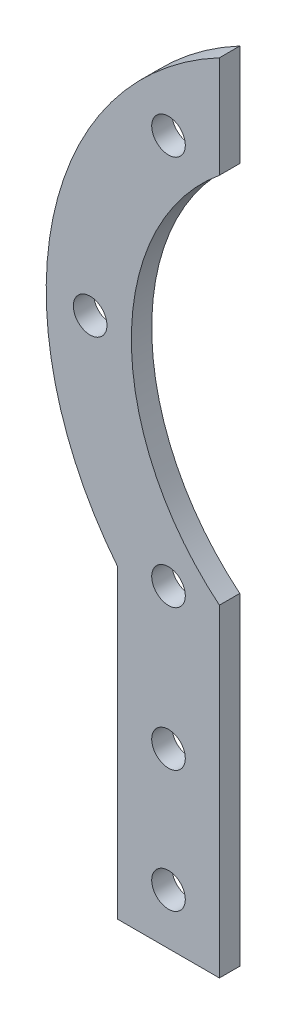
ISO-10303-21;
HEADER;
FILE_DESCRIPTION(('STEP AP214'),'2;1');
FILE_NAME('part.step','',(''),(''),'','','');
FILE_SCHEMA(('AUTOMOTIVE_DESIGN { 1 0 10303 214 1 1 1 1 }'));
ENDSEC;
DATA;
#1=APPLICATION_CONTEXT('core data for automotive mechanical design processes');
#2=APPLICATION_PROTOCOL_DEFINITION('international standard','automotive_design',2000,#1);
#3=PRODUCT_CONTEXT('',#1,'mechanical');
#4=PRODUCT('Part','Part','',(#3));
#5=PRODUCT_RELATED_PRODUCT_CATEGORY('part','',(#4));
#6=PRODUCT_DEFINITION_FORMATION('','',#4);
#7=PRODUCT_DEFINITION_CONTEXT('part definition',#1,'design');
#8=PRODUCT_DEFINITION('design','',#6,#7);
#9=PRODUCT_DEFINITION_SHAPE('','',#8);
#10=(LENGTH_UNIT() NAMED_UNIT(*) SI_UNIT(.MILLI.,.METRE.));
#11=(NAMED_UNIT(*) PLANE_ANGLE_UNIT() SI_UNIT($,.RADIAN.));
#12=(NAMED_UNIT(*) SI_UNIT($,.STERADIAN.) SOLID_ANGLE_UNIT());
#13=UNCERTAINTY_MEASURE_WITH_UNIT(LENGTH_MEASURE(1.E-05),#10,'distance_accuracy_value','');
#14=(GEOMETRIC_REPRESENTATION_CONTEXT(3) GLOBAL_UNCERTAINTY_ASSIGNED_CONTEXT((#13)) GLOBAL_UNIT_ASSIGNED_CONTEXT((#10,
#11,#12)) REPRESENTATION_CONTEXT('',''));
#15=CARTESIAN_POINT('',(0.,0.,0.));
#16=DIRECTION('',(0.,0.,1.));
#17=DIRECTION('',(1.,0.,0.));
#18=AXIS2_PLACEMENT_3D('',#15,#16,#17);
#19=CARTESIAN_POINT('',(25.,50.,2.));
#20=DIRECTION('',(0.,0.,1.));
#21=DIRECTION('',(1.,0.,0.));
#22=AXIS2_PLACEMENT_3D('',#19,#20,#21);
#23=PLANE('',#22);
#24=CARTESIAN_POINT('',(5.,69.1613487919139,2.));
#25=DIRECTION('',(0.,0.,1.));
#26=DIRECTION('',(1.,0.,0.));
#27=AXIS2_PLACEMENT_3D('',#24,#25,#26);
#28=CIRCLE('',#27,1.65);
#29=CARTESIAN_POINT('',(6.65,69.1613487919139,2.));
#30=VERTEX_POINT('',#29);
#31=EDGE_CURVE('E216',#30,#30,#28,.T.);
#32=ORIENTED_EDGE('',*,*,#31,.F.);
#33=EDGE_LOOP('',(#32));
#34=FACE_BOUND('',#33,.T.);
#35=CARTESIAN_POINT('',(5.,17.,2.));
#36=DIRECTION('',(0.,0.,1.));
#37=DIRECTION('',(1.,0.,0.));
#38=AXIS2_PLACEMENT_3D('',#35,#36,#37);
#39=CIRCLE('',#38,1.65);
#40=CARTESIAN_POINT('',(6.65,17.,2.));
#41=VERTEX_POINT('',#40);
#42=EDGE_CURVE('E232',#41,#41,#39,.T.);
#43=ORIENTED_EDGE('',*,*,#42,.F.);
#44=EDGE_LOOP('',(#43));
#45=FACE_BOUND('',#44,.T.);
#46=DIRECTION('',(0.,-1.,0.));
#47=VECTOR('',#46,1.);
#48=CARTESIAN_POINT('',(0.,0.,2.));
#49=LINE('',#48,#47);
#50=CARTESIAN_POINT('',(0.,30.,2.));
#51=VERTEX_POINT('',#50);
#52=CARTESIAN_POINT('',(0.,0.,2.));
#53=VERTEX_POINT('',#52);
#54=EDGE_CURVE('E146',#51,#53,#49,.T.);
#55=ORIENTED_EDGE('',*,*,#54,.T.);
#56=DIRECTION('',(1.,0.,0.));
#57=VECTOR('',#56,1.);
#58=CARTESIAN_POINT('',(0.,0.,2.));
#59=LINE('',#58,#57);
#60=CARTESIAN_POINT('',(10.,0.,2.));
#61=VERTEX_POINT('',#60);
#62=EDGE_CURVE('E94',#53,#61,#59,.T.);
#63=ORIENTED_EDGE('',*,*,#62,.T.);
#64=DIRECTION('',(0.,1.,0.));
#65=VECTOR('',#64,1.);
#66=CARTESIAN_POINT('',(10.,0.,2.));
#67=LINE('',#66,#65);
#68=CARTESIAN_POINT('',(10.,31.7157287525381,2.));
#69=VERTEX_POINT('',#68);
#70=EDGE_CURVE('E107',#61,#69,#67,.T.);
#71=ORIENTED_EDGE('',*,*,#70,.T.);
#72=CARTESIAN_POINT('',(25.,50.,2.));
#73=DIRECTION('',(0.,0.,-1.));
#74=DIRECTION('',(1.,0.,0.));
#75=AXIS2_PLACEMENT_3D('',#72,#73,#74);
#76=CIRCLE('',#75,23.649832452911);
#77=CARTESIAN_POINT('',(10.,68.2842712474619,2.));
#78=VERTEX_POINT('',#77);
#79=EDGE_CURVE('E101',#69,#78,#76,.T.);
#80=ORIENTED_EDGE('',*,*,#79,.T.);
#81=DIRECTION('',(0.,1.,0.));
#82=VECTOR('',#81,1.);
#83=CARTESIAN_POINT('',(10.,68.2842712474619,2.));
#84=LINE('',#83,#82);
#85=CARTESIAN_POINT('',(10.,78.2842712474619,2.));
#86=VERTEX_POINT('',#85);
#87=EDGE_CURVE('E105',#78,#86,#84,.T.);
#88=ORIENTED_EDGE('',*,*,#87,.T.);
#89=CARTESIAN_POINT('',(25.,50.,2.));
#90=DIRECTION('',(0.,0.,1.));
#91=DIRECTION('',(1.,0.,0.));
#92=AXIS2_PLACEMENT_3D('',#89,#90,#91);
#93=CIRCLE('',#92,32.0156211871642);
#94=EDGE_CURVE('E57',#86,#51,#93,.T.);
#95=ORIENTED_EDGE('',*,*,#94,.T.);
#96=EDGE_LOOP('',(#55,#63,#71,#80,#88,#95));
#97=FACE_BOUND('',#96,.T.);
#98=CARTESIAN_POINT('',(5.,5.,2.));
#99=DIRECTION('',(0.,0.,1.));
#100=DIRECTION('',(1.,0.,0.));
#101=AXIS2_PLACEMENT_3D('',#98,#99,#100);
#102=CIRCLE('',#101,1.65);
#103=CARTESIAN_POINT('',(6.65,5.,2.));
#104=VERTEX_POINT('',#103);
#105=EDGE_CURVE('E134',#104,#104,#102,.T.);
#106=ORIENTED_EDGE('',*,*,#105,.F.);
#107=EDGE_LOOP('',(#106));
#108=FACE_BOUND('',#107,.T.);
#109=CARTESIAN_POINT('',(-2.69760436437384,50.,2.));
#110=DIRECTION('',(0.,0.,1.));
#111=DIRECTION('',(1.,0.,0.));
#112=AXIS2_PLACEMENT_3D('',#109,#110,#111);
#113=CIRCLE('',#112,1.65);
#114=CARTESIAN_POINT('',(-1.04760436437384,50.,2.));
#115=VERTEX_POINT('',#114);
#116=EDGE_CURVE('E224',#115,#115,#113,.T.);
#117=ORIENTED_EDGE('',*,*,#116,.F.);
#118=EDGE_LOOP('',(#117));
#119=FACE_BOUND('',#118,.T.);
#120=CARTESIAN_POINT('',(5.,30.8386512080861,2.));
#121=DIRECTION('',(0.,0.,1.));
#122=DIRECTION('',(1.,0.,0.));
#123=AXIS2_PLACEMENT_3D('',#120,#121,#122);
#124=CIRCLE('',#123,1.65);
#125=CARTESIAN_POINT('',(6.65,30.8386512080861,2.));
#126=VERTEX_POINT('',#125);
#127=EDGE_CURVE('E205',#126,#126,#124,.T.);
#128=ORIENTED_EDGE('',*,*,#127,.F.);
#129=EDGE_LOOP('',(#128));
#130=FACE_BOUND('',#129,.T.);
#131=ADVANCED_FACE('F39',(#34,#45,#97,#108,#119,#130),#23,.T.);
#132=CARTESIAN_POINT('',(25.,50.,0.));
#133=DIRECTION('',(0.,0.,1.));
#134=DIRECTION('',(1.,0.,0.));
#135=AXIS2_PLACEMENT_3D('',#132,#133,#134);
#136=PLANE('',#135);
#137=DIRECTION('',(0.,-1.,0.));
#138=VECTOR('',#137,1.);
#139=CARTESIAN_POINT('',(0.,0.,0.));
#140=LINE('',#139,#138);
#141=CARTESIAN_POINT('',(0.,30.,0.));
#142=VERTEX_POINT('',#141);
#143=CARTESIAN_POINT('',(0.,0.,0.));
#144=VERTEX_POINT('',#143);
#145=EDGE_CURVE('E129',#142,#144,#140,.T.);
#146=ORIENTED_EDGE('',*,*,#145,.F.);
#147=CARTESIAN_POINT('',(25.,50.,0.));
#148=DIRECTION('',(0.,0.,1.));
#149=DIRECTION('',(1.,0.,0.));
#150=AXIS2_PLACEMENT_3D('',#147,#148,#149);
#151=CIRCLE('',#150,32.0156211871642);
#152=CARTESIAN_POINT('',(10.,78.2842712474619,0.));
#153=VERTEX_POINT('',#152);
#154=EDGE_CURVE('E86',#153,#142,#151,.T.);
#155=ORIENTED_EDGE('',*,*,#154,.F.);
#156=DIRECTION('',(0.,1.,0.));
#157=VECTOR('',#156,1.);
#158=CARTESIAN_POINT('',(10.,68.2842712474619,0.));
#159=LINE('',#158,#157);
#160=CARTESIAN_POINT('',(10.,68.2842712474619,0.));
#161=VERTEX_POINT('',#160);
#162=EDGE_CURVE('E80',#161,#153,#159,.T.);
#163=ORIENTED_EDGE('',*,*,#162,.F.);
#164=CARTESIAN_POINT('',(25.,50.,0.));
#165=DIRECTION('',(0.,0.,-1.));
#166=DIRECTION('',(1.,0.,0.));
#167=AXIS2_PLACEMENT_3D('',#164,#165,#166);
#168=CIRCLE('',#167,23.649832452911);
#169=CARTESIAN_POINT('',(10.,31.7157287525381,0.));
#170=VERTEX_POINT('',#169);
#171=EDGE_CURVE('E116',#170,#161,#168,.T.);
#172=ORIENTED_EDGE('',*,*,#171,.F.);
#173=DIRECTION('',(0.,1.,0.));
#174=VECTOR('',#173,1.);
#175=CARTESIAN_POINT('',(10.,0.,0.));
#176=LINE('',#175,#174);
#177=CARTESIAN_POINT('',(10.,0.,0.));
#178=VERTEX_POINT('',#177);
#179=EDGE_CURVE('E137',#178,#170,#176,.T.);
#180=ORIENTED_EDGE('',*,*,#179,.F.);
#181=DIRECTION('',(1.,0.,0.));
#182=VECTOR('',#181,1.);
#183=CARTESIAN_POINT('',(0.,0.,0.));
#184=LINE('',#183,#182);
#185=EDGE_CURVE('E133',#144,#178,#184,.T.);
#186=ORIENTED_EDGE('',*,*,#185,.F.);
#187=EDGE_LOOP('',(#146,#155,#163,#172,#180,#186));
#188=FACE_BOUND('',#187,.T.);
#189=CARTESIAN_POINT('',(5.,5.,0.));
#190=DIRECTION('',(0.,0.,1.));
#191=DIRECTION('',(1.,0.,0.));
#192=AXIS2_PLACEMENT_3D('',#189,#190,#191);
#193=CIRCLE('',#192,1.65);
#194=CARTESIAN_POINT('',(6.65,5.,0.));
#195=VERTEX_POINT('',#194);
#196=EDGE_CURVE('E236',#195,#195,#193,.T.);
#197=ORIENTED_EDGE('',*,*,#196,.T.);
#198=EDGE_LOOP('',(#197));
#199=FACE_BOUND('',#198,.T.);
#200=CARTESIAN_POINT('',(5.,17.,0.));
#201=DIRECTION('',(0.,0.,1.));
#202=DIRECTION('',(1.,0.,0.));
#203=AXIS2_PLACEMENT_3D('',#200,#201,#202);
#204=CIRCLE('',#203,1.65);
#205=CARTESIAN_POINT('',(6.65,17.,0.));
#206=VERTEX_POINT('',#205);
#207=EDGE_CURVE('E228',#206,#206,#204,.T.);
#208=ORIENTED_EDGE('',*,*,#207,.T.);
#209=EDGE_LOOP('',(#208));
#210=FACE_BOUND('',#209,.T.);
#211=CARTESIAN_POINT('',(-2.69760436437384,50.,0.));
#212=DIRECTION('',(0.,0.,1.));
#213=DIRECTION('',(1.,0.,0.));
#214=AXIS2_PLACEMENT_3D('',#211,#212,#213);
#215=CIRCLE('',#214,1.65);
#216=CARTESIAN_POINT('',(-1.04760436437384,50.,0.));
#217=VERTEX_POINT('',#216);
#218=EDGE_CURVE('E220',#217,#217,#215,.T.);
#219=ORIENTED_EDGE('',*,*,#218,.T.);
#220=EDGE_LOOP('',(#219));
#221=FACE_BOUND('',#220,.T.);
#222=CARTESIAN_POINT('',(5.,69.1613487919139,0.));
#223=DIRECTION('',(0.,0.,1.));
#224=DIRECTION('',(1.,0.,0.));
#225=AXIS2_PLACEMENT_3D('',#222,#223,#224);
#226=CIRCLE('',#225,1.65);
#227=CARTESIAN_POINT('',(6.65,69.1613487919139,0.));
#228=VERTEX_POINT('',#227);
#229=EDGE_CURVE('E213',#228,#228,#226,.T.);
#230=ORIENTED_EDGE('',*,*,#229,.T.);
#231=EDGE_LOOP('',(#230));
#232=FACE_BOUND('',#231,.T.);
#233=CARTESIAN_POINT('',(5.,30.8386512080861,0.));
#234=DIRECTION('',(0.,0.,1.));
#235=DIRECTION('',(1.,0.,0.));
#236=AXIS2_PLACEMENT_3D('',#233,#234,#235);
#237=CIRCLE('',#236,1.65);
#238=CARTESIAN_POINT('',(6.65,30.8386512080861,0.));
#239=VERTEX_POINT('',#238);
#240=EDGE_CURVE('E208',#239,#239,#237,.T.);
#241=ORIENTED_EDGE('',*,*,#240,.T.);
#242=EDGE_LOOP('',(#241));
#243=FACE_BOUND('',#242,.T.);
#244=ADVANCED_FACE('F159',(#188,#199,#210,#221,#232,#243),#136,.F.);
#245=CARTESIAN_POINT('',(0.,0.,2.));
#246=DIRECTION('',(1.,0.,0.));
#247=DIRECTION('',(0.,0.,-1.));
#248=AXIS2_PLACEMENT_3D('',#245,#246,#247);
#249=PLANE('',#248);
#250=ORIENTED_EDGE('',*,*,#145,.T.);
#251=DIRECTION('',(0.,0.,-1.));
#252=VECTOR('',#251,1.);
#253=CARTESIAN_POINT('',(0.,0.,2.));
#254=LINE('',#253,#252);
#255=EDGE_CURVE('E11',#53,#144,#254,.T.);
#256=ORIENTED_EDGE('',*,*,#255,.F.);
#257=ORIENTED_EDGE('',*,*,#54,.F.);
#258=DIRECTION('',(0.,0.,-1.));
#259=VECTOR('',#258,1.);
#260=CARTESIAN_POINT('',(0.,30.,2.));
#261=LINE('',#260,#259);
#262=EDGE_CURVE('E125',#51,#142,#261,.T.);
#263=ORIENTED_EDGE('',*,*,#262,.T.);
#264=EDGE_LOOP('',(#250,#256,#257,#263));
#265=FACE_BOUND('',#264,.T.);
#266=ADVANCED_FACE('F41',(#265),#249,.F.);
#267=CARTESIAN_POINT('',(0.,0.,2.));
#268=DIRECTION('',(0.,1.,0.));
#269=DIRECTION('',(0.,0.,1.));
#270=AXIS2_PLACEMENT_3D('',#267,#268,#269);
#271=PLANE('',#270);
#272=ORIENTED_EDGE('',*,*,#185,.T.);
#273=DIRECTION('',(0.,0.,-1.));
#274=VECTOR('',#273,1.);
#275=CARTESIAN_POINT('',(10.,0.,2.));
#276=LINE('',#275,#274);
#277=EDGE_CURVE('E49',#61,#178,#276,.T.);
#278=ORIENTED_EDGE('',*,*,#277,.F.);
#279=ORIENTED_EDGE('',*,*,#62,.F.);
#280=ORIENTED_EDGE('',*,*,#255,.T.);
#281=EDGE_LOOP('',(#272,#278,#279,#280));
#282=FACE_BOUND('',#281,.T.);
#283=ADVANCED_FACE('F309',(#282),#271,.F.);
#284=CARTESIAN_POINT('',(10.,0.,2.));
#285=DIRECTION('',(-1.,0.,0.));
#286=DIRECTION('',(0.,0.,1.));
#287=AXIS2_PLACEMENT_3D('',#284,#285,#286);
#288=PLANE('',#287);
#289=ORIENTED_EDGE('',*,*,#179,.T.);
#290=DIRECTION('',(0.,0.,-1.));
#291=VECTOR('',#290,1.);
#292=CARTESIAN_POINT('',(10.,31.7157287525381,2.));
#293=LINE('',#292,#291);
#294=EDGE_CURVE('E118',#69,#170,#293,.T.);
#295=ORIENTED_EDGE('',*,*,#294,.F.);
#296=ORIENTED_EDGE('',*,*,#70,.F.);
#297=ORIENTED_EDGE('',*,*,#277,.T.);
#298=EDGE_LOOP('',(#289,#295,#296,#297));
#299=FACE_BOUND('',#298,.T.);
#300=ADVANCED_FACE('F156',(#299),#288,.F.);
#301=CARTESIAN_POINT('',(25.,50.,2.));
#302=DIRECTION('',(0.,0.,-1.));
#303=DIRECTION('',(-1.,0.,0.));
#304=AXIS2_PLACEMENT_3D('',#301,#302,#303);
#305=CYLINDRICAL_SURFACE('',#304,23.649832452911);
#306=ORIENTED_EDGE('',*,*,#171,.T.);
#307=DIRECTION('',(0.,0.,-1.));
#308=VECTOR('',#307,1.);
#309=CARTESIAN_POINT('',(10.,68.2842712474619,2.));
#310=LINE('',#309,#308);
#311=EDGE_CURVE('E113',#78,#161,#310,.T.);
#312=ORIENTED_EDGE('',*,*,#311,.F.);
#313=ORIENTED_EDGE('',*,*,#79,.F.);
#314=ORIENTED_EDGE('',*,*,#294,.T.);
#315=EDGE_LOOP('',(#306,#312,#313,#314));
#316=FACE_BOUND('',#315,.T.);
#317=ADVANCED_FACE('F114',(#316),#305,.F.);
#318=CARTESIAN_POINT('',(10.,68.2842712474619,2.));
#319=DIRECTION('',(-1.,0.,0.));
#320=DIRECTION('',(0.,-1.,0.));
#321=AXIS2_PLACEMENT_3D('',#318,#319,#320);
#322=PLANE('',#321);
#323=ORIENTED_EDGE('',*,*,#162,.T.);
#324=DIRECTION('',(0.,0.,-1.));
#325=VECTOR('',#324,1.);
#326=CARTESIAN_POINT('',(10.,78.2842712474619,2.));
#327=LINE('',#326,#325);
#328=EDGE_CURVE('E119',#86,#153,#327,.T.);
#329=ORIENTED_EDGE('',*,*,#328,.F.);
#330=ORIENTED_EDGE('',*,*,#87,.F.);
#331=ORIENTED_EDGE('',*,*,#311,.T.);
#332=EDGE_LOOP('',(#323,#329,#330,#331));
#333=FACE_BOUND('',#332,.T.);
#334=ADVANCED_FACE('F121',(#333),#322,.F.);
#335=CARTESIAN_POINT('',(25.,50.,2.));
#336=DIRECTION('',(0.,0.,-1.));
#337=DIRECTION('',(-1.,0.,0.));
#338=AXIS2_PLACEMENT_3D('',#335,#336,#337);
#339=CYLINDRICAL_SURFACE('',#338,32.0156211871642);
#340=ORIENTED_EDGE('',*,*,#154,.T.);
#341=ORIENTED_EDGE('',*,*,#262,.F.);
#342=ORIENTED_EDGE('',*,*,#94,.F.);
#343=ORIENTED_EDGE('',*,*,#328,.T.);
#344=EDGE_LOOP('',(#340,#341,#342,#343));
#345=FACE_BOUND('',#344,.T.);
#346=ADVANCED_FACE('F164',(#345),#339,.T.);
#347=CARTESIAN_POINT('',(5.,5.,2.));
#348=DIRECTION('',(0.,0.,-1.));
#349=DIRECTION('',(-1.,0.,0.));
#350=AXIS2_PLACEMENT_3D('',#347,#348,#349);
#351=CYLINDRICAL_SURFACE('',#350,1.65);
#352=ORIENTED_EDGE('',*,*,#105,.T.);
#353=EDGE_LOOP('',(#352));
#354=FACE_BOUND('',#353,.T.);
#355=ORIENTED_EDGE('',*,*,#196,.F.);
#356=EDGE_LOOP('',(#355));
#357=FACE_BOUND('',#356,.T.);
#358=ADVANCED_FACE('F166',(#354,#357),#351,.F.);
#359=CARTESIAN_POINT('',(5.,17.,2.));
#360=DIRECTION('',(0.,0.,-1.));
#361=DIRECTION('',(-1.,0.,0.));
#362=AXIS2_PLACEMENT_3D('',#359,#360,#361);
#363=CYLINDRICAL_SURFACE('',#362,1.65);
#364=ORIENTED_EDGE('',*,*,#42,.T.);
#365=EDGE_LOOP('',(#364));
#366=FACE_BOUND('',#365,.T.);
#367=ORIENTED_EDGE('',*,*,#207,.F.);
#368=EDGE_LOOP('',(#367));
#369=FACE_BOUND('',#368,.T.);
#370=ADVANCED_FACE('F172',(#366,#369),#363,.F.);
#371=CARTESIAN_POINT('',(-2.69760436437384,50.,2.));
#372=DIRECTION('',(0.,0.,-1.));
#373=DIRECTION('',(-1.,0.,0.));
#374=AXIS2_PLACEMENT_3D('',#371,#372,#373);
#375=CYLINDRICAL_SURFACE('',#374,1.65);
#376=ORIENTED_EDGE('',*,*,#116,.T.);
#377=EDGE_LOOP('',(#376));
#378=FACE_BOUND('',#377,.T.);
#379=ORIENTED_EDGE('',*,*,#218,.F.);
#380=EDGE_LOOP('',(#379));
#381=FACE_BOUND('',#380,.T.);
#382=ADVANCED_FACE('F188',(#378,#381),#375,.F.);
#383=CARTESIAN_POINT('',(5.,69.1613487919139,2.));
#384=DIRECTION('',(0.,0.,-1.));
#385=DIRECTION('',(-1.,0.,0.));
#386=AXIS2_PLACEMENT_3D('',#383,#384,#385);
#387=CYLINDRICAL_SURFACE('',#386,1.65);
#388=ORIENTED_EDGE('',*,*,#31,.T.);
#389=EDGE_LOOP('',(#388));
#390=FACE_BOUND('',#389,.T.);
#391=ORIENTED_EDGE('',*,*,#229,.F.);
#392=EDGE_LOOP('',(#391));
#393=FACE_BOUND('',#392,.T.);
#394=ADVANCED_FACE('F192',(#390,#393),#387,.F.);
#395=CARTESIAN_POINT('',(5.,30.8386512080861,2.));
#396=DIRECTION('',(0.,0.,-1.));
#397=DIRECTION('',(-1.,0.,0.));
#398=AXIS2_PLACEMENT_3D('',#395,#396,#397);
#399=CYLINDRICAL_SURFACE('',#398,1.65);
#400=ORIENTED_EDGE('',*,*,#127,.T.);
#401=EDGE_LOOP('',(#400));
#402=FACE_BOUND('',#401,.T.);
#403=ORIENTED_EDGE('',*,*,#240,.F.);
#404=EDGE_LOOP('',(#403));
#405=FACE_BOUND('',#404,.T.);
#406=ADVANCED_FACE('F196',(#402,#405),#399,.F.);
#407=CLOSED_SHELL('',(#131,#244,#266,#283,#300,#317,#334,#346,#358,#370,#382,#394,#406));
#408=MANIFOLD_SOLID_BREP('B2',#407);
#409=ADVANCED_BREP_SHAPE_REPRESENTATION('',(#18,#408),#14);
#410=SHAPE_DEFINITION_REPRESENTATION(#9,#409);
ENDSEC;
END-ISO-10303-21;
